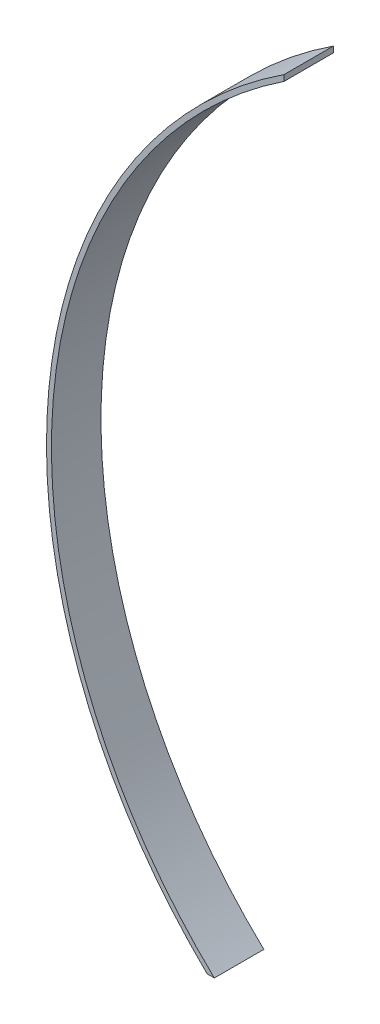
ISO-10303-21;
HEADER;
FILE_DESCRIPTION(('STEP AP214'),'2;1');
FILE_NAME('part.step','',(''),(''),'','','');
FILE_SCHEMA(('AUTOMOTIVE_DESIGN { 1 0 10303 214 1 1 1 1 }'));
ENDSEC;
DATA;
#1=APPLICATION_CONTEXT('core data for automotive mechanical design processes');
#2=APPLICATION_PROTOCOL_DEFINITION('international standard','automotive_design',2000,#1);
#3=PRODUCT_CONTEXT('',#1,'mechanical');
#4=PRODUCT('Part','Part','',(#3));
#5=PRODUCT_RELATED_PRODUCT_CATEGORY('part','',(#4));
#6=PRODUCT_DEFINITION_FORMATION('','',#4);
#7=PRODUCT_DEFINITION_CONTEXT('part definition',#1,'design');
#8=PRODUCT_DEFINITION('design','',#6,#7);
#9=PRODUCT_DEFINITION_SHAPE('','',#8);
#10=(LENGTH_UNIT() NAMED_UNIT(*) SI_UNIT(.MILLI.,.METRE.));
#11=(NAMED_UNIT(*) PLANE_ANGLE_UNIT() SI_UNIT($,.RADIAN.));
#12=(NAMED_UNIT(*) SI_UNIT($,.STERADIAN.) SOLID_ANGLE_UNIT());
#13=UNCERTAINTY_MEASURE_WITH_UNIT(LENGTH_MEASURE(1.E-05),#10,'distance_accuracy_value','');
#14=(GEOMETRIC_REPRESENTATION_CONTEXT(3) GLOBAL_UNCERTAINTY_ASSIGNED_CONTEXT((#13)) GLOBAL_UNIT_ASSIGNED_CONTEXT((#10,
#11,#12)) REPRESENTATION_CONTEXT('',''));
#15=CARTESIAN_POINT('',(0.,0.,0.));
#16=DIRECTION('',(0.,0.,1.));
#17=DIRECTION('',(1.,0.,0.));
#18=AXIS2_PLACEMENT_3D('',#15,#16,#17);
#19=CARTESIAN_POINT('',(47.1036092035419,97.5,10.));
#20=DIRECTION('',(0.,0.,-1.));
#21=DIRECTION('',(-1.,0.,0.));
#22=AXIS2_PLACEMENT_3D('',#19,#20,#21);
#23=CYLINDRICAL_SURFACE('',#22,106.);
#24=CARTESIAN_POINT('',(47.1036092035419,97.5,0.));
#25=DIRECTION('',(0.,0.,1.));
#26=DIRECTION('',(1.,0.,0.));
#27=AXIS2_PLACEMENT_3D('',#24,#25,#26);
#28=CIRCLE('',#27,106.);
#29=CARTESIAN_POINT('',(-10.9373246276775,186.197519694747,0.));
#30=VERTEX_POINT('',#29);
#31=CARTESIAN_POINT('',(-26.4486202676107,21.1713059208864,0.));
#32=VERTEX_POINT('',#31);
#33=EDGE_CURVE('E98',#30,#32,#28,.T.);
#34=ORIENTED_EDGE('',*,*,#33,.T.);
#35=DIRECTION('',(0.,0.,-1.));
#36=VECTOR('',#35,1.);
#37=CARTESIAN_POINT('',(-26.4486202676107,21.1713059208864,10.));
#38=LINE('',#37,#36);
#39=CARTESIAN_POINT('',(-26.4486202676107,21.1713059208864,10.));
#40=VERTEX_POINT('',#39);
#41=EDGE_CURVE('E11',#40,#32,#38,.T.);
#42=ORIENTED_EDGE('',*,*,#41,.F.);
#43=CARTESIAN_POINT('',(47.1036092035419,97.5,10.));
#44=DIRECTION('',(0.,0.,1.));
#45=DIRECTION('',(1.,0.,0.));
#46=AXIS2_PLACEMENT_3D('',#43,#44,#45);
#47=CIRCLE('',#46,106.);
#48=CARTESIAN_POINT('',(-10.9373246276775,186.197519694747,10.));
#49=VERTEX_POINT('',#48);
#50=EDGE_CURVE('E86',#49,#40,#47,.T.);
#51=ORIENTED_EDGE('',*,*,#50,.F.);
#52=DIRECTION('',(0.,0.,-1.));
#53=VECTOR('',#52,1.);
#54=CARTESIAN_POINT('',(-10.9373246276775,186.197519694747,10.));
#55=LINE('',#54,#53);
#56=EDGE_CURVE('E94',#49,#30,#55,.T.);
#57=ORIENTED_EDGE('',*,*,#56,.T.);
#58=EDGE_LOOP('',(#34,#42,#51,#57));
#59=FACE_BOUND('',#58,.T.);
#60=ADVANCED_FACE('F35',(#59),#23,.T.);
#61=CARTESIAN_POINT('',(-25.,21.1713059208864,10.));
#62=DIRECTION('',(0.,1.,0.));
#63=DIRECTION('',(0.,0.,1.));
#64=AXIS2_PLACEMENT_3D('',#61,#62,#63);
#65=PLANE('',#64);
#66=DIRECTION('',(1.,0.,0.));
#67=VECTOR('',#66,1.);
#68=CARTESIAN_POINT('',(-25.,21.1713059208864,0.));
#69=LINE('',#68,#67);
#70=CARTESIAN_POINT('',(-25.,21.1713059208865,0.));
#71=VERTEX_POINT('',#70);
#72=EDGE_CURVE('E90',#32,#71,#69,.T.);
#73=ORIENTED_EDGE('',*,*,#72,.T.);
#74=DIRECTION('',(0.,0.,-1.));
#75=VECTOR('',#74,1.);
#76=CARTESIAN_POINT('',(-25.,21.1713059208865,10.));
#77=LINE('',#76,#75);
#78=CARTESIAN_POINT('',(-25.,21.1713059208865,10.));
#79=VERTEX_POINT('',#78);
#80=EDGE_CURVE('E43',#79,#71,#77,.T.);
#81=ORIENTED_EDGE('',*,*,#80,.F.);
#82=DIRECTION('',(1.,0.,0.));
#83=VECTOR('',#82,1.);
#84=CARTESIAN_POINT('',(-25.,21.1713059208864,10.));
#85=LINE('',#84,#83);
#86=EDGE_CURVE('E81',#40,#79,#85,.T.);
#87=ORIENTED_EDGE('',*,*,#86,.F.);
#88=ORIENTED_EDGE('',*,*,#41,.T.);
#89=EDGE_LOOP('',(#73,#81,#87,#88));
#90=FACE_BOUND('',#89,.T.);
#91=ADVANCED_FACE('F89',(#90),#65,.F.);
#92=CARTESIAN_POINT('',(47.1036092035419,97.5,10.));
#93=DIRECTION('',(0.,0.,-1.));
#94=DIRECTION('',(-1.,0.,0.));
#95=AXIS2_PLACEMENT_3D('',#92,#93,#94);
#96=CYLINDRICAL_SURFACE('',#95,105.);
#97=CARTESIAN_POINT('',(47.1036092035419,97.5,0.));
#98=DIRECTION('',(0.,0.,-1.));
#99=DIRECTION('',(1.,0.,0.));
#100=AXIS2_PLACEMENT_3D('',#97,#98,#99);
#101=CIRCLE('',#100,105.);
#102=CARTESIAN_POINT('',(-10.9373246276776,185.,0.));
#103=VERTEX_POINT('',#102);
#104=EDGE_CURVE('E68',#71,#103,#101,.T.);
#105=ORIENTED_EDGE('',*,*,#104,.T.);
#106=DIRECTION('',(0.,0.,-1.));
#107=VECTOR('',#106,1.);
#108=CARTESIAN_POINT('',(-10.9373246276776,185.,10.));
#109=LINE('',#108,#107);
#110=CARTESIAN_POINT('',(-10.9373246276776,185.,10.));
#111=VERTEX_POINT('',#110);
#112=EDGE_CURVE('E91',#111,#103,#109,.T.);
#113=ORIENTED_EDGE('',*,*,#112,.F.);
#114=CARTESIAN_POINT('',(47.1036092035419,97.5,10.));
#115=DIRECTION('',(0.,0.,-1.));
#116=DIRECTION('',(1.,0.,0.));
#117=AXIS2_PLACEMENT_3D('',#114,#115,#116);
#118=CIRCLE('',#117,105.);
#119=EDGE_CURVE('E84',#79,#111,#118,.T.);
#120=ORIENTED_EDGE('',*,*,#119,.F.);
#121=ORIENTED_EDGE('',*,*,#80,.T.);
#122=EDGE_LOOP('',(#105,#113,#120,#121));
#123=FACE_BOUND('',#122,.T.);
#124=ADVANCED_FACE('F92',(#123),#96,.F.);
#125=CARTESIAN_POINT('',(-10.9373246276776,185.,10.));
#126=DIRECTION('',(-1.,0.,0.));
#127=DIRECTION('',(0.,-1.,0.));
#128=AXIS2_PLACEMENT_3D('',#125,#126,#127);
#129=PLANE('',#128);
#130=DIRECTION('',(0.,1.,0.));
#131=VECTOR('',#130,1.);
#132=CARTESIAN_POINT('',(-10.9373246276776,185.,0.));
#133=LINE('',#132,#131);
#134=EDGE_CURVE('E74',#103,#30,#133,.T.);
#135=ORIENTED_EDGE('',*,*,#134,.T.);
#136=ORIENTED_EDGE('',*,*,#56,.F.);
#137=DIRECTION('',(0.,1.,0.));
#138=VECTOR('',#137,1.);
#139=CARTESIAN_POINT('',(-10.9373246276776,185.,10.));
#140=LINE('',#139,#138);
#141=EDGE_CURVE('E51',#111,#49,#140,.T.);
#142=ORIENTED_EDGE('',*,*,#141,.F.);
#143=ORIENTED_EDGE('',*,*,#112,.T.);
#144=EDGE_LOOP('',(#135,#136,#142,#143));
#145=FACE_BOUND('',#144,.T.);
#146=ADVANCED_FACE('F105',(#145),#129,.F.);
#147=CARTESIAN_POINT('',(47.1036092035419,97.5,10.));
#148=DIRECTION('',(0.,0.,1.));
#149=DIRECTION('',(1.,0.,0.));
#150=AXIS2_PLACEMENT_3D('',#147,#148,#149);
#151=PLANE('',#150);
#152=ORIENTED_EDGE('',*,*,#50,.T.);
#153=ORIENTED_EDGE('',*,*,#86,.T.);
#154=ORIENTED_EDGE('',*,*,#119,.T.);
#155=ORIENTED_EDGE('',*,*,#141,.T.);
#156=EDGE_LOOP('',(#152,#153,#154,#155));
#157=FACE_BOUND('',#156,.T.);
#158=ADVANCED_FACE('F82',(#157),#151,.T.);
#159=CARTESIAN_POINT('',(47.1036092035419,97.5,0.));
#160=DIRECTION('',(0.,0.,1.));
#161=DIRECTION('',(1.,0.,0.));
#162=AXIS2_PLACEMENT_3D('',#159,#160,#161);
#163=PLANE('',#162);
#164=ORIENTED_EDGE('',*,*,#33,.F.);
#165=ORIENTED_EDGE('',*,*,#134,.F.);
#166=ORIENTED_EDGE('',*,*,#104,.F.);
#167=ORIENTED_EDGE('',*,*,#72,.F.);
#168=EDGE_LOOP('',(#164,#165,#166,#167));
#169=FACE_BOUND('',#168,.T.);
#170=ADVANCED_FACE('F108',(#169),#163,.F.);
#171=CLOSED_SHELL('',(#60,#91,#124,#146,#158,#170));
#172=MANIFOLD_SOLID_BREP('B2',#171);
#173=ADVANCED_BREP_SHAPE_REPRESENTATION('',(#18,#172),#14);
#174=SHAPE_DEFINITION_REPRESENTATION(#9,#173);
ENDSEC;
END-ISO-10303-21;
